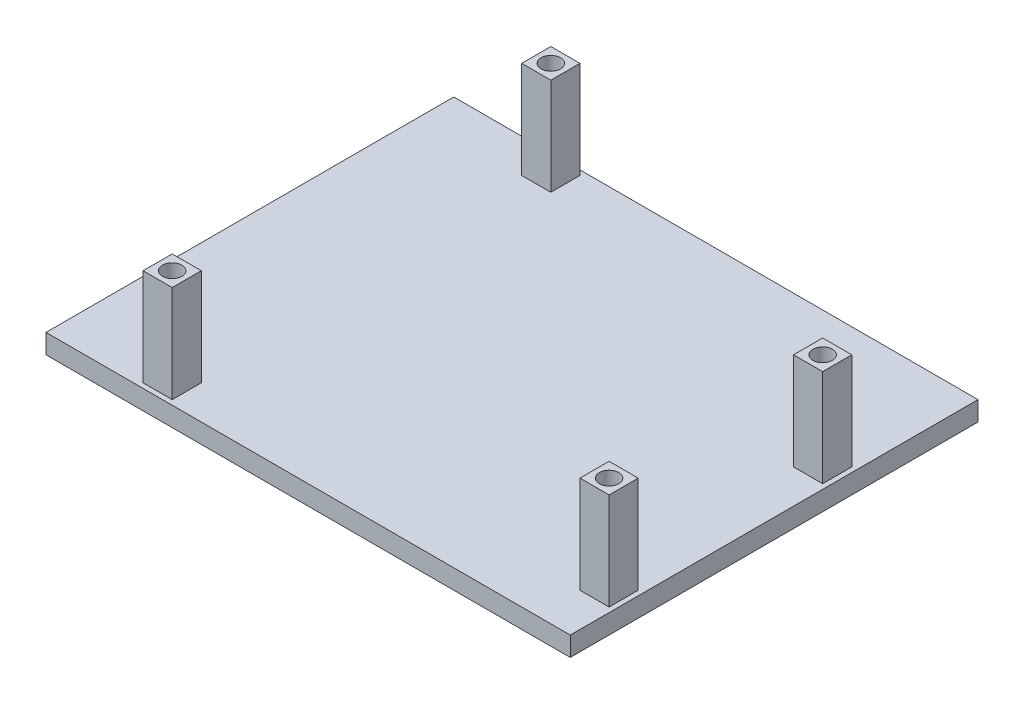
ISO-10303-21;
HEADER;
FILE_DESCRIPTION(('STEP AP214'),'2;1');
FILE_NAME('part.step','',(''),(''),'','','');
FILE_SCHEMA(('AUTOMOTIVE_DESIGN { 1 0 10303 214 1 1 1 1 }'));
ENDSEC;
DATA;
#1=APPLICATION_CONTEXT('core data for automotive mechanical design processes');
#2=APPLICATION_PROTOCOL_DEFINITION('international standard','automotive_design',2000,#1);
#3=PRODUCT_CONTEXT('',#1,'mechanical');
#4=PRODUCT('Part','Part','',(#3));
#5=PRODUCT_RELATED_PRODUCT_CATEGORY('part','',(#4));
#6=PRODUCT_DEFINITION_FORMATION('','',#4);
#7=PRODUCT_DEFINITION_CONTEXT('part definition',#1,'design');
#8=PRODUCT_DEFINITION('design','',#6,#7);
#9=PRODUCT_DEFINITION_SHAPE('','',#8);
#10=(LENGTH_UNIT() NAMED_UNIT(*) SI_UNIT(.MILLI.,.METRE.));
#11=(NAMED_UNIT(*) PLANE_ANGLE_UNIT() SI_UNIT($,.RADIAN.));
#12=(NAMED_UNIT(*) SI_UNIT($,.STERADIAN.) SOLID_ANGLE_UNIT());
#13=UNCERTAINTY_MEASURE_WITH_UNIT(LENGTH_MEASURE(1.E-05),#10,'distance_accuracy_value','');
#14=(GEOMETRIC_REPRESENTATION_CONTEXT(3) GLOBAL_UNCERTAINTY_ASSIGNED_CONTEXT((#13)) GLOBAL_UNIT_ASSIGNED_CONTEXT((#10,
#11,#12)) REPRESENTATION_CONTEXT('',''));
#15=CARTESIAN_POINT('',(0.,0.,0.));
#16=DIRECTION('',(0.,0.,1.));
#17=DIRECTION('',(1.,0.,0.));
#18=AXIS2_PLACEMENT_3D('',#15,#16,#17);
#19=CARTESIAN_POINT('',(0.,2.54,0.));
#20=DIRECTION('',(1.,0.,0.));
#21=DIRECTION('',(0.,0.,-1.));
#22=AXIS2_PLACEMENT_3D('',#19,#20,#21);
#23=PLANE('',#22);
#24=DIRECTION('',(0.,0.,1.));
#25=VECTOR('',#24,1.);
#26=CARTESIAN_POINT('',(0.,0.,0.));
#27=LINE('',#26,#25);
#28=CARTESIAN_POINT('',(0.,0.,-53.34));
#29=VERTEX_POINT('',#28);
#30=CARTESIAN_POINT('',(0.,0.,0.));
#31=VERTEX_POINT('',#30);
#32=EDGE_CURVE('E313',#29,#31,#27,.T.);
#33=ORIENTED_EDGE('',*,*,#32,.T.);
#34=DIRECTION('',(0.,-1.,0.));
#35=VECTOR('',#34,1.);
#36=CARTESIAN_POINT('',(0.,2.54,0.));
#37=LINE('',#36,#35);
#38=CARTESIAN_POINT('',(0.,2.54,0.));
#39=VERTEX_POINT('',#38);
#40=EDGE_CURVE('E11',#39,#31,#37,.T.);
#41=ORIENTED_EDGE('',*,*,#40,.F.);
#42=DIRECTION('',(0.,0.,1.));
#43=VECTOR('',#42,1.);
#44=CARTESIAN_POINT('',(0.,2.54,0.));
#45=LINE('',#44,#43);
#46=CARTESIAN_POINT('',(0.,2.54,-53.34));
#47=VERTEX_POINT('',#46);
#48=EDGE_CURVE('E314',#47,#39,#45,.T.);
#49=ORIENTED_EDGE('',*,*,#48,.F.);
#50=DIRECTION('',(0.,-1.,0.));
#51=VECTOR('',#50,1.);
#52=CARTESIAN_POINT('',(0.,2.54,-53.34));
#53=LINE('',#52,#51);
#54=EDGE_CURVE('E324',#47,#29,#53,.T.);
#55=ORIENTED_EDGE('',*,*,#54,.T.);
#56=EDGE_LOOP('',(#33,#41,#49,#55));
#57=FACE_BOUND('',#56,.T.);
#58=ADVANCED_FACE('F33',(#57),#23,.F.);
#59=CARTESIAN_POINT('',(0.,2.54,0.));
#60=DIRECTION('',(0.,0.,-1.));
#61=DIRECTION('',(-1.,0.,0.));
#62=AXIS2_PLACEMENT_3D('',#59,#60,#61);
#63=PLANE('',#62);
#64=DIRECTION('',(1.,0.,0.));
#65=VECTOR('',#64,1.);
#66=CARTESIAN_POINT('',(0.,0.,0.));
#67=LINE('',#66,#65);
#68=CARTESIAN_POINT('',(68.58,0.,0.));
#69=VERTEX_POINT('',#68);
#70=EDGE_CURVE('E327',#31,#69,#67,.T.);
#71=ORIENTED_EDGE('',*,*,#70,.T.);
#72=DIRECTION('',(0.,-1.,0.));
#73=VECTOR('',#72,1.);
#74=CARTESIAN_POINT('',(68.58,2.54,0.));
#75=LINE('',#74,#73);
#76=CARTESIAN_POINT('',(68.58,2.54,0.));
#77=VERTEX_POINT('',#76);
#78=EDGE_CURVE('E40',#77,#69,#75,.T.);
#79=ORIENTED_EDGE('',*,*,#78,.F.);
#80=DIRECTION('',(1.,0.,0.));
#81=VECTOR('',#80,1.);
#82=CARTESIAN_POINT('',(0.,2.54,0.));
#83=LINE('',#82,#81);
#84=EDGE_CURVE('E317',#39,#77,#83,.T.);
#85=ORIENTED_EDGE('',*,*,#84,.F.);
#86=ORIENTED_EDGE('',*,*,#40,.T.);
#87=EDGE_LOOP('',(#71,#79,#85,#86));
#88=FACE_BOUND('',#87,.T.);
#89=ADVANCED_FACE('F357',(#88),#63,.F.);
#90=CARTESIAN_POINT('',(68.58,2.54,0.));
#91=DIRECTION('',(-1.,0.,0.));
#92=DIRECTION('',(0.,0.,1.));
#93=AXIS2_PLACEMENT_3D('',#90,#91,#92);
#94=PLANE('',#93);
#95=DIRECTION('',(0.,0.,-1.));
#96=VECTOR('',#95,1.);
#97=CARTESIAN_POINT('',(68.58,0.,0.));
#98=LINE('',#97,#96);
#99=CARTESIAN_POINT('',(68.58,0.,-53.34));
#100=VERTEX_POINT('',#99);
#101=EDGE_CURVE('E329',#69,#100,#98,.T.);
#102=ORIENTED_EDGE('',*,*,#101,.T.);
#103=DIRECTION('',(0.,-1.,0.));
#104=VECTOR('',#103,1.);
#105=CARTESIAN_POINT('',(68.58,2.54,-53.34));
#106=LINE('',#105,#104);
#107=CARTESIAN_POINT('',(68.58,2.54,-53.34));
#108=VERTEX_POINT('',#107);
#109=EDGE_CURVE('E334',#108,#100,#106,.T.);
#110=ORIENTED_EDGE('',*,*,#109,.F.);
#111=DIRECTION('',(0.,0.,-1.));
#112=VECTOR('',#111,1.);
#113=CARTESIAN_POINT('',(68.58,2.54,0.));
#114=LINE('',#113,#112);
#115=EDGE_CURVE('E320',#77,#108,#114,.T.);
#116=ORIENTED_EDGE('',*,*,#115,.F.);
#117=ORIENTED_EDGE('',*,*,#78,.T.);
#118=EDGE_LOOP('',(#102,#110,#116,#117));
#119=FACE_BOUND('',#118,.T.);
#120=ADVANCED_FACE('F341',(#119),#94,.F.);
#121=CARTESIAN_POINT('',(0.,2.54,-53.34));
#122=DIRECTION('',(0.,0.,1.));
#123=DIRECTION('',(1.,0.,0.));
#124=AXIS2_PLACEMENT_3D('',#121,#122,#123);
#125=PLANE('',#124);
#126=DIRECTION('',(-1.,0.,0.));
#127=VECTOR('',#126,1.);
#128=CARTESIAN_POINT('',(0.,0.,-53.34));
#129=LINE('',#128,#127);
#130=EDGE_CURVE('E318',#100,#29,#129,.T.);
#131=ORIENTED_EDGE('',*,*,#130,.T.);
#132=ORIENTED_EDGE('',*,*,#54,.F.);
#133=DIRECTION('',(-1.,0.,0.));
#134=VECTOR('',#133,1.);
#135=CARTESIAN_POINT('',(0.,2.54,-53.34));
#136=LINE('',#135,#134);
#137=EDGE_CURVE('E322',#108,#47,#136,.T.);
#138=ORIENTED_EDGE('',*,*,#137,.F.);
#139=ORIENTED_EDGE('',*,*,#109,.T.);
#140=EDGE_LOOP('',(#131,#132,#138,#139));
#141=FACE_BOUND('',#140,.T.);
#142=ADVANCED_FACE('F350',(#141),#125,.F.);
#143=CARTESIAN_POINT('',(0.,2.54,0.));
#144=DIRECTION('',(0.,-1.,0.));
#145=DIRECTION('',(0.,0.,-1.));
#146=AXIS2_PLACEMENT_3D('',#143,#144,#145);
#147=PLANE('',#146);
#148=DIRECTION('',(0.,0.,-1.));
#149=VECTOR('',#148,1.);
#150=CARTESIAN_POINT('',(67.945,2.54,-5.71500000000001));
#151=LINE('',#150,#149);
#152=CARTESIAN_POINT('',(67.945,2.54,-5.71500000000001));
#153=VERTEX_POINT('',#152);
#154=CARTESIAN_POINT('',(67.945,2.54,-9.52500000000001));
#155=VERTEX_POINT('',#154);
#156=EDGE_CURVE('E190',#153,#155,#151,.T.);
#157=ORIENTED_EDGE('',*,*,#156,.F.);
#158=DIRECTION('',(1.,0.,0.));
#159=VECTOR('',#158,1.);
#160=CARTESIAN_POINT('',(64.135,2.54,-5.71500000000001));
#161=LINE('',#160,#159);
#162=CARTESIAN_POINT('',(64.135,2.54,-5.71500000000001));
#163=VERTEX_POINT('',#162);
#164=EDGE_CURVE('E187',#163,#153,#161,.T.);
#165=ORIENTED_EDGE('',*,*,#164,.F.);
#166=DIRECTION('',(0.,0.,1.));
#167=VECTOR('',#166,1.);
#168=CARTESIAN_POINT('',(64.135,2.54,-5.71500000000001));
#169=LINE('',#168,#167);
#170=CARTESIAN_POINT('',(64.135,2.54,-9.52500000000001));
#171=VERTEX_POINT('',#170);
#172=EDGE_CURVE('E52',#171,#163,#169,.T.);
#173=ORIENTED_EDGE('',*,*,#172,.F.);
#174=DIRECTION('',(-1.,0.,0.));
#175=VECTOR('',#174,1.);
#176=CARTESIAN_POINT('',(64.135,2.54,-9.52500000000001));
#177=LINE('',#176,#175);
#178=EDGE_CURVE('E47',#155,#171,#177,.T.);
#179=ORIENTED_EDGE('',*,*,#178,.F.);
#180=EDGE_LOOP('',(#157,#165,#173,#179));
#181=FACE_BOUND('',#180,.T.);
#182=DIRECTION('',(0.,0.,-1.));
#183=VECTOR('',#182,1.);
#184=CARTESIAN_POINT('',(67.945,2.54,-33.655));
#185=LINE('',#184,#183);
#186=CARTESIAN_POINT('',(67.945,2.54,-33.655));
#187=VERTEX_POINT('',#186);
#188=CARTESIAN_POINT('',(67.945,2.54,-37.465));
#189=VERTEX_POINT('',#188);
#190=EDGE_CURVE('E201',#187,#189,#185,.T.);
#191=ORIENTED_EDGE('',*,*,#190,.F.);
#192=DIRECTION('',(1.,0.,0.));
#193=VECTOR('',#192,1.);
#194=CARTESIAN_POINT('',(64.135,2.54,-33.655));
#195=LINE('',#194,#193);
#196=CARTESIAN_POINT('',(64.135,2.54,-33.655));
#197=VERTEX_POINT('',#196);
#198=EDGE_CURVE('E207',#197,#187,#195,.T.);
#199=ORIENTED_EDGE('',*,*,#198,.F.);
#200=DIRECTION('',(0.,0.,1.));
#201=VECTOR('',#200,1.);
#202=CARTESIAN_POINT('',(64.135,2.54,-33.655));
#203=LINE('',#202,#201);
#204=CARTESIAN_POINT('',(64.135,2.54,-37.465));
#205=VERTEX_POINT('',#204);
#206=EDGE_CURVE('E219',#205,#197,#203,.T.);
#207=ORIENTED_EDGE('',*,*,#206,.F.);
#208=DIRECTION('',(-1.,0.,0.));
#209=VECTOR('',#208,1.);
#210=CARTESIAN_POINT('',(64.135,2.54,-37.465));
#211=LINE('',#210,#209);
#212=EDGE_CURVE('E216',#189,#205,#211,.T.);
#213=ORIENTED_EDGE('',*,*,#212,.F.);
#214=EDGE_LOOP('',(#191,#199,#207,#213));
#215=FACE_BOUND('',#214,.T.);
#216=DIRECTION('',(0.,0.,-1.));
#217=VECTOR('',#216,1.);
#218=CARTESIAN_POINT('',(17.145,2.54,-52.705));
#219=LINE('',#218,#217);
#220=CARTESIAN_POINT('',(17.145,2.54,-48.895));
#221=VERTEX_POINT('',#220);
#222=CARTESIAN_POINT('',(17.145,2.54,-52.705));
#223=VERTEX_POINT('',#222);
#224=EDGE_CURVE('E239',#221,#223,#219,.T.);
#225=ORIENTED_EDGE('',*,*,#224,.F.);
#226=DIRECTION('',(1.,0.,0.));
#227=VECTOR('',#226,1.);
#228=CARTESIAN_POINT('',(13.335,2.54,-48.895));
#229=LINE('',#228,#227);
#230=CARTESIAN_POINT('',(13.335,2.54,-48.895));
#231=VERTEX_POINT('',#230);
#232=EDGE_CURVE('E246',#231,#221,#229,.T.);
#233=ORIENTED_EDGE('',*,*,#232,.F.);
#234=DIRECTION('',(0.,0.,1.));
#235=VECTOR('',#234,1.);
#236=CARTESIAN_POINT('',(13.335,2.54,-52.705));
#237=LINE('',#236,#235);
#238=CARTESIAN_POINT('',(13.335,2.54,-52.705));
#239=VERTEX_POINT('',#238);
#240=EDGE_CURVE('E258',#239,#231,#237,.T.);
#241=ORIENTED_EDGE('',*,*,#240,.F.);
#242=DIRECTION('',(-1.,0.,0.));
#243=VECTOR('',#242,1.);
#244=CARTESIAN_POINT('',(13.335,2.54,-52.705));
#245=LINE('',#244,#243);
#246=EDGE_CURVE('E255',#223,#239,#245,.T.);
#247=ORIENTED_EDGE('',*,*,#246,.F.);
#248=EDGE_LOOP('',(#225,#233,#241,#247));
#249=FACE_BOUND('',#248,.T.);
#250=DIRECTION('',(0.,0.,-1.));
#251=VECTOR('',#250,1.);
#252=CARTESIAN_POINT('',(15.875,2.54,-0.635000000000001));
#253=LINE('',#252,#251);
#254=CARTESIAN_POINT('',(15.875,2.54,-0.635000000000001));
#255=VERTEX_POINT('',#254);
#256=CARTESIAN_POINT('',(15.875,2.54,-4.445));
#257=VERTEX_POINT('',#256);
#258=EDGE_CURVE('E278',#255,#257,#253,.T.);
#259=ORIENTED_EDGE('',*,*,#258,.F.);
#260=DIRECTION('',(1.,0.,0.));
#261=VECTOR('',#260,1.);
#262=CARTESIAN_POINT('',(12.065,2.54,-0.635000000000001));
#263=LINE('',#262,#261);
#264=CARTESIAN_POINT('',(12.065,2.54,-0.635000000000001));
#265=VERTEX_POINT('',#264);
#266=EDGE_CURVE('E285',#265,#255,#263,.T.);
#267=ORIENTED_EDGE('',*,*,#266,.F.);
#268=DIRECTION('',(0.,0.,1.));
#269=VECTOR('',#268,1.);
#270=CARTESIAN_POINT('',(12.065,2.54,-0.635000000000001));
#271=LINE('',#270,#269);
#272=CARTESIAN_POINT('',(12.065,2.54,-4.445));
#273=VERTEX_POINT('',#272);
#274=EDGE_CURVE('E297',#273,#265,#271,.T.);
#275=ORIENTED_EDGE('',*,*,#274,.F.);
#276=DIRECTION('',(-1.,0.,0.));
#277=VECTOR('',#276,1.);
#278=CARTESIAN_POINT('',(12.065,2.54,-4.445));
#279=LINE('',#278,#277);
#280=EDGE_CURVE('E294',#257,#273,#279,.T.);
#281=ORIENTED_EDGE('',*,*,#280,.F.);
#282=EDGE_LOOP('',(#259,#267,#275,#281));
#283=FACE_BOUND('',#282,.T.);
#284=ORIENTED_EDGE('',*,*,#48,.T.);
#285=ORIENTED_EDGE('',*,*,#84,.T.);
#286=ORIENTED_EDGE('',*,*,#115,.T.);
#287=ORIENTED_EDGE('',*,*,#137,.T.);
#288=EDGE_LOOP('',(#284,#285,#286,#287));
#289=FACE_BOUND('',#288,.T.);
#290=ADVANCED_FACE('F356',(#181,#215,#249,#283,#289),#147,.F.);
#291=CARTESIAN_POINT('',(0.,0.,0.));
#292=DIRECTION('',(0.,-1.,0.));
#293=DIRECTION('',(0.,0.,-1.));
#294=AXIS2_PLACEMENT_3D('',#291,#292,#293);
#295=PLANE('',#294);
#296=ORIENTED_EDGE('',*,*,#32,.F.);
#297=ORIENTED_EDGE('',*,*,#130,.F.);
#298=ORIENTED_EDGE('',*,*,#101,.F.);
#299=ORIENTED_EDGE('',*,*,#70,.F.);
#300=EDGE_LOOP('',(#296,#297,#298,#299));
#301=FACE_BOUND('',#300,.T.);
#302=ADVANCED_FACE('F347',(#301),#295,.T.);
#303=CARTESIAN_POINT('',(0.,15.24,0.));
#304=DIRECTION('',(0.,-1.,0.));
#305=DIRECTION('',(0.,0.,-1.));
#306=AXIS2_PLACEMENT_3D('',#303,#304,#305);
#307=PLANE('',#306);
#308=DIRECTION('',(0.,0.,-1.));
#309=VECTOR('',#308,1.);
#310=CARTESIAN_POINT('',(15.875,15.24,-0.635000000000001));
#311=LINE('',#310,#309);
#312=CARTESIAN_POINT('',(15.875,15.24,-0.635000000000001));
#313=VERTEX_POINT('',#312);
#314=CARTESIAN_POINT('',(15.875,15.24,-4.445));
#315=VERTEX_POINT('',#314);
#316=EDGE_CURVE('E281',#313,#315,#311,.T.);
#317=ORIENTED_EDGE('',*,*,#316,.T.);
#318=DIRECTION('',(-1.,0.,0.));
#319=VECTOR('',#318,1.);
#320=CARTESIAN_POINT('',(12.065,15.24,-4.445));
#321=LINE('',#320,#319);
#322=CARTESIAN_POINT('',(12.065,15.24,-4.445));
#323=VERTEX_POINT('',#322);
#324=EDGE_CURVE('E284',#315,#323,#321,.T.);
#325=ORIENTED_EDGE('',*,*,#324,.T.);
#326=DIRECTION('',(0.,0.,1.));
#327=VECTOR('',#326,1.);
#328=CARTESIAN_POINT('',(12.065,15.24,-0.635000000000001));
#329=LINE('',#328,#327);
#330=CARTESIAN_POINT('',(12.065,15.24,-0.635000000000001));
#331=VERTEX_POINT('',#330);
#332=EDGE_CURVE('E287',#323,#331,#329,.T.);
#333=ORIENTED_EDGE('',*,*,#332,.T.);
#334=DIRECTION('',(1.,0.,0.));
#335=VECTOR('',#334,1.);
#336=CARTESIAN_POINT('',(12.065,15.24,-0.635000000000001));
#337=LINE('',#336,#335);
#338=EDGE_CURVE('E289',#331,#313,#337,.T.);
#339=ORIENTED_EDGE('',*,*,#338,.T.);
#340=EDGE_LOOP('',(#317,#325,#333,#339));
#341=FACE_BOUND('',#340,.T.);
#342=CARTESIAN_POINT('',(13.97,15.24,-2.54));
#343=DIRECTION('',(0.,1.,0.));
#344=DIRECTION('',(0.,0.,1.));
#345=AXIS2_PLACEMENT_3D('',#342,#343,#344);
#346=CIRCLE('',#345,1.27);
#347=CARTESIAN_POINT('',(13.97,15.24,-1.27));
#348=VERTEX_POINT('',#347);
#349=EDGE_CURVE('E275',#348,#348,#346,.T.);
#350=ORIENTED_EDGE('',*,*,#349,.F.);
#351=EDGE_LOOP('',(#350));
#352=FACE_BOUND('',#351,.T.);
#353=ADVANCED_FACE('F369',(#341,#352),#307,.F.);
#354=CARTESIAN_POINT('',(15.875,15.24,-0.635000000000001));
#355=DIRECTION('',(-1.,0.,0.));
#356=DIRECTION('',(0.,0.,1.));
#357=AXIS2_PLACEMENT_3D('',#354,#355,#356);
#358=PLANE('',#357);
#359=ORIENTED_EDGE('',*,*,#258,.T.);
#360=DIRECTION('',(0.,-1.,0.));
#361=VECTOR('',#360,1.);
#362=CARTESIAN_POINT('',(15.875,15.24,-4.445));
#363=LINE('',#362,#361);
#364=EDGE_CURVE('E310',#315,#257,#363,.T.);
#365=ORIENTED_EDGE('',*,*,#364,.F.);
#366=ORIENTED_EDGE('',*,*,#316,.F.);
#367=DIRECTION('',(0.,-1.,0.));
#368=VECTOR('',#367,1.);
#369=CARTESIAN_POINT('',(15.875,15.24,-0.635000000000001));
#370=LINE('',#369,#368);
#371=EDGE_CURVE('E291',#313,#255,#370,.T.);
#372=ORIENTED_EDGE('',*,*,#371,.T.);
#373=EDGE_LOOP('',(#359,#365,#366,#372));
#374=FACE_BOUND('',#373,.T.);
#375=ADVANCED_FACE('F374',(#374),#358,.F.);
#376=CARTESIAN_POINT('',(12.065,15.24,-4.445));
#377=DIRECTION('',(0.,0.,1.));
#378=DIRECTION('',(1.,0.,0.));
#379=AXIS2_PLACEMENT_3D('',#376,#377,#378);
#380=PLANE('',#379);
#381=ORIENTED_EDGE('',*,*,#280,.T.);
#382=DIRECTION('',(0.,-1.,0.));
#383=VECTOR('',#382,1.);
#384=CARTESIAN_POINT('',(12.065,15.24,-4.445));
#385=LINE('',#384,#383);
#386=EDGE_CURVE('E307',#323,#273,#385,.T.);
#387=ORIENTED_EDGE('',*,*,#386,.F.);
#388=ORIENTED_EDGE('',*,*,#324,.F.);
#389=ORIENTED_EDGE('',*,*,#364,.T.);
#390=EDGE_LOOP('',(#381,#387,#388,#389));
#391=FACE_BOUND('',#390,.T.);
#392=ADVANCED_FACE('F377',(#391),#380,.F.);
#393=CARTESIAN_POINT('',(12.065,15.24,-0.635000000000001));
#394=DIRECTION('',(1.,0.,0.));
#395=DIRECTION('',(0.,0.,-1.));
#396=AXIS2_PLACEMENT_3D('',#393,#394,#395);
#397=PLANE('',#396);
#398=ORIENTED_EDGE('',*,*,#274,.T.);
#399=DIRECTION('',(0.,-1.,0.));
#400=VECTOR('',#399,1.);
#401=CARTESIAN_POINT('',(12.065,15.24,-0.635000000000001));
#402=LINE('',#401,#400);
#403=EDGE_CURVE('E304',#331,#265,#402,.T.);
#404=ORIENTED_EDGE('',*,*,#403,.F.);
#405=ORIENTED_EDGE('',*,*,#332,.F.);
#406=ORIENTED_EDGE('',*,*,#386,.T.);
#407=EDGE_LOOP('',(#398,#404,#405,#406));
#408=FACE_BOUND('',#407,.T.);
#409=ADVANCED_FACE('F381',(#408),#397,.F.);
#410=CARTESIAN_POINT('',(12.065,15.24,-0.635000000000001));
#411=DIRECTION('',(0.,0.,-1.));
#412=DIRECTION('',(-1.,0.,0.));
#413=AXIS2_PLACEMENT_3D('',#410,#411,#412);
#414=PLANE('',#413);
#415=ORIENTED_EDGE('',*,*,#266,.T.);
#416=ORIENTED_EDGE('',*,*,#371,.F.);
#417=ORIENTED_EDGE('',*,*,#338,.F.);
#418=ORIENTED_EDGE('',*,*,#403,.T.);
#419=EDGE_LOOP('',(#415,#416,#417,#418));
#420=FACE_BOUND('',#419,.T.);
#421=ADVANCED_FACE('F385',(#420),#414,.F.);
#422=CARTESIAN_POINT('',(13.97,15.24,-2.54));
#423=DIRECTION('',(0.,-1.,0.));
#424=DIRECTION('',(0.,0.,-1.));
#425=AXIS2_PLACEMENT_3D('',#422,#423,#424);
#426=CYLINDRICAL_SURFACE('',#425,1.27);
#427=ORIENTED_EDGE('',*,*,#349,.T.);
#428=EDGE_LOOP('',(#427));
#429=FACE_BOUND('',#428,.T.);
#430=CARTESIAN_POINT('',(13.97,2.54,-2.54));
#431=DIRECTION('',(0.,1.,0.));
#432=DIRECTION('',(0.,0.,1.));
#433=AXIS2_PLACEMENT_3D('',#430,#431,#432);
#434=CIRCLE('',#433,1.27);
#435=CARTESIAN_POINT('',(13.97,2.54,-1.27));
#436=VERTEX_POINT('',#435);
#437=EDGE_CURVE('E274',#436,#436,#434,.T.);
#438=ORIENTED_EDGE('',*,*,#437,.F.);
#439=EDGE_LOOP('',(#438));
#440=FACE_BOUND('',#439,.T.);
#441=ADVANCED_FACE('F389',(#429,#440),#426,.F.);
#442=ORIENTED_EDGE('',*,*,#437,.T.);
#443=EDGE_LOOP('',(#442));
#444=FACE_BOUND('',#443,.T.);
#445=ADVANCED_FACE('F373',(#444),#147,.F.);
#446=CARTESIAN_POINT('',(0.,15.24,0.));
#447=DIRECTION('',(0.,1.,0.));
#448=DIRECTION('',(0.,0.,1.));
#449=AXIS2_PLACEMENT_3D('',#446,#447,#448);
#450=PLANE('',#449);
#451=DIRECTION('',(0.,0.,-1.));
#452=VECTOR('',#451,1.);
#453=CARTESIAN_POINT('',(17.145,15.24,-52.705));
#454=LINE('',#453,#452);
#455=CARTESIAN_POINT('',(17.145,15.24,-48.895));
#456=VERTEX_POINT('',#455);
#457=CARTESIAN_POINT('',(17.145,15.24,-52.705));
#458=VERTEX_POINT('',#457);
#459=EDGE_CURVE('E242',#456,#458,#454,.T.);
#460=ORIENTED_EDGE('',*,*,#459,.T.);
#461=DIRECTION('',(-1.,0.,0.));
#462=VECTOR('',#461,1.);
#463=CARTESIAN_POINT('',(13.335,15.24,-52.705));
#464=LINE('',#463,#462);
#465=CARTESIAN_POINT('',(13.335,15.24,-52.705));
#466=VERTEX_POINT('',#465);
#467=EDGE_CURVE('E245',#458,#466,#464,.T.);
#468=ORIENTED_EDGE('',*,*,#467,.T.);
#469=DIRECTION('',(0.,0.,1.));
#470=VECTOR('',#469,1.);
#471=CARTESIAN_POINT('',(13.335,15.24,-52.705));
#472=LINE('',#471,#470);
#473=CARTESIAN_POINT('',(13.335,15.24,-48.895));
#474=VERTEX_POINT('',#473);
#475=EDGE_CURVE('E248',#466,#474,#472,.T.);
#476=ORIENTED_EDGE('',*,*,#475,.T.);
#477=DIRECTION('',(1.,0.,0.));
#478=VECTOR('',#477,1.);
#479=CARTESIAN_POINT('',(13.335,15.24,-48.895));
#480=LINE('',#479,#478);
#481=EDGE_CURVE('E250',#474,#456,#480,.T.);
#482=ORIENTED_EDGE('',*,*,#481,.T.);
#483=EDGE_LOOP('',(#460,#468,#476,#482));
#484=FACE_BOUND('',#483,.T.);
#485=CARTESIAN_POINT('',(15.24,15.24,-50.8));
#486=DIRECTION('',(0.,1.,0.));
#487=DIRECTION('',(0.,0.,1.));
#488=AXIS2_PLACEMENT_3D('',#485,#486,#487);
#489=CIRCLE('',#488,1.27);
#490=CARTESIAN_POINT('',(15.24,15.24,-49.53));
#491=VERTEX_POINT('',#490);
#492=EDGE_CURVE('E236',#491,#491,#489,.T.);
#493=ORIENTED_EDGE('',*,*,#492,.F.);
#494=EDGE_LOOP('',(#493));
#495=FACE_BOUND('',#494,.T.);
#496=ADVANCED_FACE('F401',(#484,#495),#450,.T.);
#497=CARTESIAN_POINT('',(17.145,15.24,-52.705));
#498=DIRECTION('',(-1.,0.,0.));
#499=DIRECTION('',(0.,0.,1.));
#500=AXIS2_PLACEMENT_3D('',#497,#498,#499);
#501=PLANE('',#500);
#502=ORIENTED_EDGE('',*,*,#224,.T.);
#503=DIRECTION('',(0.,-1.,0.));
#504=VECTOR('',#503,1.);
#505=CARTESIAN_POINT('',(17.145,15.24,-52.705));
#506=LINE('',#505,#504);
#507=EDGE_CURVE('E271',#458,#223,#506,.T.);
#508=ORIENTED_EDGE('',*,*,#507,.F.);
#509=ORIENTED_EDGE('',*,*,#459,.F.);
#510=DIRECTION('',(0.,-1.,0.));
#511=VECTOR('',#510,1.);
#512=CARTESIAN_POINT('',(17.145,15.24,-48.895));
#513=LINE('',#512,#511);
#514=EDGE_CURVE('E252',#456,#221,#513,.T.);
#515=ORIENTED_EDGE('',*,*,#514,.T.);
#516=EDGE_LOOP('',(#502,#508,#509,#515));
#517=FACE_BOUND('',#516,.T.);
#518=ADVANCED_FACE('F397',(#517),#501,.F.);
#519=CARTESIAN_POINT('',(13.335,15.24,-52.705));
#520=DIRECTION('',(0.,0.,1.));
#521=DIRECTION('',(1.,0.,0.));
#522=AXIS2_PLACEMENT_3D('',#519,#520,#521);
#523=PLANE('',#522);
#524=ORIENTED_EDGE('',*,*,#246,.T.);
#525=DIRECTION('',(0.,-1.,0.));
#526=VECTOR('',#525,1.);
#527=CARTESIAN_POINT('',(13.335,15.24,-52.705));
#528=LINE('',#527,#526);
#529=EDGE_CURVE('E268',#466,#239,#528,.T.);
#530=ORIENTED_EDGE('',*,*,#529,.F.);
#531=ORIENTED_EDGE('',*,*,#467,.F.);
#532=ORIENTED_EDGE('',*,*,#507,.T.);
#533=EDGE_LOOP('',(#524,#530,#531,#532));
#534=FACE_BOUND('',#533,.T.);
#535=ADVANCED_FACE('F400',(#534),#523,.F.);
#536=CARTESIAN_POINT('',(13.335,15.24,-52.705));
#537=DIRECTION('',(1.,0.,0.));
#538=DIRECTION('',(0.,0.,-1.));
#539=AXIS2_PLACEMENT_3D('',#536,#537,#538);
#540=PLANE('',#539);
#541=ORIENTED_EDGE('',*,*,#240,.T.);
#542=DIRECTION('',(0.,-1.,0.));
#543=VECTOR('',#542,1.);
#544=CARTESIAN_POINT('',(13.335,15.24,-48.895));
#545=LINE('',#544,#543);
#546=EDGE_CURVE('E265',#474,#231,#545,.T.);
#547=ORIENTED_EDGE('',*,*,#546,.F.);
#548=ORIENTED_EDGE('',*,*,#475,.F.);
#549=ORIENTED_EDGE('',*,*,#529,.T.);
#550=EDGE_LOOP('',(#541,#547,#548,#549));
#551=FACE_BOUND('',#550,.T.);
#552=ADVANCED_FACE('F405',(#551),#540,.F.);
#553=CARTESIAN_POINT('',(13.335,15.24,-48.895));
#554=DIRECTION('',(0.,0.,-1.));
#555=DIRECTION('',(-1.,0.,0.));
#556=AXIS2_PLACEMENT_3D('',#553,#554,#555);
#557=PLANE('',#556);
#558=ORIENTED_EDGE('',*,*,#232,.T.);
#559=ORIENTED_EDGE('',*,*,#514,.F.);
#560=ORIENTED_EDGE('',*,*,#481,.F.);
#561=ORIENTED_EDGE('',*,*,#546,.T.);
#562=EDGE_LOOP('',(#558,#559,#560,#561));
#563=FACE_BOUND('',#562,.T.);
#564=ADVANCED_FACE('F409',(#563),#557,.F.);
#565=CARTESIAN_POINT('',(15.24,15.24,-50.8));
#566=DIRECTION('',(0.,-1.,0.));
#567=DIRECTION('',(0.,0.,-1.));
#568=AXIS2_PLACEMENT_3D('',#565,#566,#567);
#569=CYLINDRICAL_SURFACE('',#568,1.27);
#570=ORIENTED_EDGE('',*,*,#492,.T.);
#571=EDGE_LOOP('',(#570));
#572=FACE_BOUND('',#571,.T.);
#573=CARTESIAN_POINT('',(15.24,2.54,-50.8));
#574=DIRECTION('',(0.,1.,0.));
#575=DIRECTION('',(0.,0.,1.));
#576=AXIS2_PLACEMENT_3D('',#573,#574,#575);
#577=CIRCLE('',#576,1.27);
#578=CARTESIAN_POINT('',(15.24,2.54,-49.53));
#579=VERTEX_POINT('',#578);
#580=EDGE_CURVE('E235',#579,#579,#577,.T.);
#581=ORIENTED_EDGE('',*,*,#580,.F.);
#582=EDGE_LOOP('',(#581));
#583=FACE_BOUND('',#582,.T.);
#584=ADVANCED_FACE('F413',(#572,#583),#569,.F.);
#585=ORIENTED_EDGE('',*,*,#580,.T.);
#586=EDGE_LOOP('',(#585));
#587=FACE_BOUND('',#586,.T.);
#588=ADVANCED_FACE('F420',(#587),#147,.F.);
#589=CARTESIAN_POINT('',(0.,15.24,0.));
#590=DIRECTION('',(0.,-1.,0.));
#591=DIRECTION('',(0.,0.,-1.));
#592=AXIS2_PLACEMENT_3D('',#589,#590,#591);
#593=PLANE('',#592);
#594=DIRECTION('',(0.,0.,-1.));
#595=VECTOR('',#594,1.);
#596=CARTESIAN_POINT('',(67.945,15.24,-33.655));
#597=LINE('',#596,#595);
#598=CARTESIAN_POINT('',(67.945,15.24,-33.655));
#599=VERTEX_POINT('',#598);
#600=CARTESIAN_POINT('',(67.945,15.24,-37.465));
#601=VERTEX_POINT('',#600);
#602=EDGE_CURVE('E203',#599,#601,#597,.T.);
#603=ORIENTED_EDGE('',*,*,#602,.T.);
#604=DIRECTION('',(-1.,0.,0.));
#605=VECTOR('',#604,1.);
#606=CARTESIAN_POINT('',(64.135,15.24,-37.465));
#607=LINE('',#606,#605);
#608=CARTESIAN_POINT('',(64.135,15.24,-37.465));
#609=VERTEX_POINT('',#608);
#610=EDGE_CURVE('E206',#601,#609,#607,.T.);
#611=ORIENTED_EDGE('',*,*,#610,.T.);
#612=DIRECTION('',(0.,0.,1.));
#613=VECTOR('',#612,1.);
#614=CARTESIAN_POINT('',(64.135,15.24,-33.655));
#615=LINE('',#614,#613);
#616=CARTESIAN_POINT('',(64.135,15.24,-33.655));
#617=VERTEX_POINT('',#616);
#618=EDGE_CURVE('E209',#609,#617,#615,.T.);
#619=ORIENTED_EDGE('',*,*,#618,.T.);
#620=DIRECTION('',(1.,0.,0.));
#621=VECTOR('',#620,1.);
#622=CARTESIAN_POINT('',(64.135,15.24,-33.655));
#623=LINE('',#622,#621);
#624=EDGE_CURVE('E211',#617,#599,#623,.T.);
#625=ORIENTED_EDGE('',*,*,#624,.T.);
#626=EDGE_LOOP('',(#603,#611,#619,#625));
#627=FACE_BOUND('',#626,.T.);
#628=CARTESIAN_POINT('',(66.04,15.24,-35.56));
#629=DIRECTION('',(0.,1.,0.));
#630=DIRECTION('',(0.,0.,1.));
#631=AXIS2_PLACEMENT_3D('',#628,#629,#630);
#632=CIRCLE('',#631,1.26999999999999);
#633=CARTESIAN_POINT('',(66.04,15.24,-34.29));
#634=VERTEX_POINT('',#633);
#635=EDGE_CURVE('E194',#634,#634,#632,.T.);
#636=ORIENTED_EDGE('',*,*,#635,.F.);
#637=EDGE_LOOP('',(#636));
#638=FACE_BOUND('',#637,.T.);
#639=ADVANCED_FACE('F426',(#627,#638),#593,.F.);
#640=CARTESIAN_POINT('',(67.945,15.24,-33.655));
#641=DIRECTION('',(-1.,0.,0.));
#642=DIRECTION('',(0.,0.,1.));
#643=AXIS2_PLACEMENT_3D('',#640,#641,#642);
#644=PLANE('',#643);
#645=ORIENTED_EDGE('',*,*,#190,.T.);
#646=DIRECTION('',(0.,-1.,0.));
#647=VECTOR('',#646,1.);
#648=CARTESIAN_POINT('',(67.945,15.24,-37.465));
#649=LINE('',#648,#647);
#650=EDGE_CURVE('E232',#601,#189,#649,.T.);
#651=ORIENTED_EDGE('',*,*,#650,.F.);
#652=ORIENTED_EDGE('',*,*,#602,.F.);
#653=DIRECTION('',(0.,-1.,0.));
#654=VECTOR('',#653,1.);
#655=CARTESIAN_POINT('',(67.945,15.24,-33.655));
#656=LINE('',#655,#654);
#657=EDGE_CURVE('E213',#599,#187,#656,.T.);
#658=ORIENTED_EDGE('',*,*,#657,.T.);
#659=EDGE_LOOP('',(#645,#651,#652,#658));
#660=FACE_BOUND('',#659,.T.);
#661=ADVANCED_FACE('F422',(#660),#644,.F.);
#662=CARTESIAN_POINT('',(64.135,15.24,-37.465));
#663=DIRECTION('',(0.,0.,1.));
#664=DIRECTION('',(1.,0.,0.));
#665=AXIS2_PLACEMENT_3D('',#662,#663,#664);
#666=PLANE('',#665);
#667=ORIENTED_EDGE('',*,*,#212,.T.);
#668=DIRECTION('',(0.,-1.,0.));
#669=VECTOR('',#668,1.);
#670=CARTESIAN_POINT('',(64.135,15.24,-37.465));
#671=LINE('',#670,#669);
#672=EDGE_CURVE('E229',#609,#205,#671,.T.);
#673=ORIENTED_EDGE('',*,*,#672,.F.);
#674=ORIENTED_EDGE('',*,*,#610,.F.);
#675=ORIENTED_EDGE('',*,*,#650,.T.);
#676=EDGE_LOOP('',(#667,#673,#674,#675));
#677=FACE_BOUND('',#676,.T.);
#678=ADVANCED_FACE('F425',(#677),#666,.F.);
#679=CARTESIAN_POINT('',(64.135,15.24,-33.655));
#680=DIRECTION('',(1.,0.,0.));
#681=DIRECTION('',(0.,0.,-1.));
#682=AXIS2_PLACEMENT_3D('',#679,#680,#681);
#683=PLANE('',#682);
#684=ORIENTED_EDGE('',*,*,#206,.T.);
#685=DIRECTION('',(0.,-1.,0.));
#686=VECTOR('',#685,1.);
#687=CARTESIAN_POINT('',(64.135,15.24,-33.655));
#688=LINE('',#687,#686);
#689=EDGE_CURVE('E226',#617,#197,#688,.T.);
#690=ORIENTED_EDGE('',*,*,#689,.F.);
#691=ORIENTED_EDGE('',*,*,#618,.F.);
#692=ORIENTED_EDGE('',*,*,#672,.T.);
#693=EDGE_LOOP('',(#684,#690,#691,#692));
#694=FACE_BOUND('',#693,.T.);
#695=ADVANCED_FACE('F430',(#694),#683,.F.);
#696=CARTESIAN_POINT('',(64.135,15.24,-33.655));
#697=DIRECTION('',(0.,0.,-1.));
#698=DIRECTION('',(-1.,0.,0.));
#699=AXIS2_PLACEMENT_3D('',#696,#697,#698);
#700=PLANE('',#699);
#701=ORIENTED_EDGE('',*,*,#198,.T.);
#702=ORIENTED_EDGE('',*,*,#657,.F.);
#703=ORIENTED_EDGE('',*,*,#624,.F.);
#704=ORIENTED_EDGE('',*,*,#689,.T.);
#705=EDGE_LOOP('',(#701,#702,#703,#704));
#706=FACE_BOUND('',#705,.T.);
#707=ADVANCED_FACE('F434',(#706),#700,.F.);
#708=CARTESIAN_POINT('',(66.04,15.24,-35.56));
#709=DIRECTION('',(0.,-1.,0.));
#710=DIRECTION('',(0.,0.,-1.));
#711=AXIS2_PLACEMENT_3D('',#708,#709,#710);
#712=CYLINDRICAL_SURFACE('',#711,1.26999999999999);
#713=ORIENTED_EDGE('',*,*,#635,.T.);
#714=EDGE_LOOP('',(#713));
#715=FACE_BOUND('',#714,.T.);
#716=CARTESIAN_POINT('',(66.04,2.54,-35.56));
#717=DIRECTION('',(0.,1.,0.));
#718=DIRECTION('',(0.,0.,1.));
#719=AXIS2_PLACEMENT_3D('',#716,#717,#718);
#720=CIRCLE('',#719,1.26999999999999);
#721=CARTESIAN_POINT('',(66.04,2.54,-34.29));
#722=VERTEX_POINT('',#721);
#723=EDGE_CURVE('E191',#722,#722,#720,.T.);
#724=ORIENTED_EDGE('',*,*,#723,.F.);
#725=EDGE_LOOP('',(#724));
#726=FACE_BOUND('',#725,.T.);
#727=ADVANCED_FACE('F438',(#715,#726),#712,.F.);
#728=ORIENTED_EDGE('',*,*,#723,.T.);
#729=EDGE_LOOP('',(#728));
#730=FACE_BOUND('',#729,.T.);
#731=ADVANCED_FACE('F445',(#730),#147,.F.);
#732=CARTESIAN_POINT('',(0.,15.24,0.));
#733=DIRECTION('',(0.,-1.,0.));
#734=DIRECTION('',(0.,0.,-1.));
#735=AXIS2_PLACEMENT_3D('',#732,#733,#734);
#736=PLANE('',#735);
#737=DIRECTION('',(0.,0.,-1.));
#738=VECTOR('',#737,1.);
#739=CARTESIAN_POINT('',(67.945,15.24,-5.71500000000001));
#740=LINE('',#739,#738);
#741=CARTESIAN_POINT('',(67.945,15.24,-5.71500000000001));
#742=VERTEX_POINT('',#741);
#743=CARTESIAN_POINT('',(67.945,15.24,-9.52500000000001));
#744=VERTEX_POINT('',#743);
#745=EDGE_CURVE('E177',#742,#744,#740,.T.);
#746=ORIENTED_EDGE('',*,*,#745,.T.);
#747=DIRECTION('',(-1.,0.,0.));
#748=VECTOR('',#747,1.);
#749=CARTESIAN_POINT('',(64.135,15.24,-9.52500000000001));
#750=LINE('',#749,#748);
#751=CARTESIAN_POINT('',(64.135,15.24,-9.52500000000001));
#752=VERTEX_POINT('',#751);
#753=EDGE_CURVE('E166',#744,#752,#750,.T.);
#754=ORIENTED_EDGE('',*,*,#753,.T.);
#755=DIRECTION('',(0.,0.,1.));
#756=VECTOR('',#755,1.);
#757=CARTESIAN_POINT('',(64.135,15.24,-5.71500000000001));
#758=LINE('',#757,#756);
#759=CARTESIAN_POINT('',(64.135,15.24,-5.71500000000001));
#760=VERTEX_POINT('',#759);
#761=EDGE_CURVE('E176',#752,#760,#758,.T.);
#762=ORIENTED_EDGE('',*,*,#761,.T.);
#763=DIRECTION('',(1.,0.,0.));
#764=VECTOR('',#763,1.);
#765=CARTESIAN_POINT('',(64.135,15.24,-5.71500000000001));
#766=LINE('',#765,#764);
#767=EDGE_CURVE('E183',#760,#742,#766,.T.);
#768=ORIENTED_EDGE('',*,*,#767,.T.);
#769=EDGE_LOOP('',(#746,#754,#762,#768));
#770=FACE_BOUND('',#769,.T.);
#771=CARTESIAN_POINT('',(66.04,15.24,-7.62000000000001));
#772=DIRECTION('',(0.,1.,0.));
#773=DIRECTION('',(0.,0.,1.));
#774=AXIS2_PLACEMENT_3D('',#771,#772,#773);
#775=CIRCLE('',#774,1.26999999999999);
#776=CARTESIAN_POINT('',(66.04,15.24,-6.35000000000002));
#777=VERTEX_POINT('',#776);
#778=EDGE_CURVE('E471',#777,#777,#775,.T.);
#779=ORIENTED_EDGE('',*,*,#778,.F.);
#780=EDGE_LOOP('',(#779));
#781=FACE_BOUND('',#780,.T.);
#782=ADVANCED_FACE('F180',(#770,#781),#736,.F.);
#783=CARTESIAN_POINT('',(67.945,15.24,-5.71500000000001));
#784=DIRECTION('',(-1.,0.,0.));
#785=DIRECTION('',(0.,0.,1.));
#786=AXIS2_PLACEMENT_3D('',#783,#784,#785);
#787=PLANE('',#786);
#788=ORIENTED_EDGE('',*,*,#156,.T.);
#789=DIRECTION('',(0.,-1.,0.));
#790=VECTOR('',#789,1.);
#791=CARTESIAN_POINT('',(67.945,15.24,-9.52500000000001));
#792=LINE('',#791,#790);
#793=EDGE_CURVE('E170',#744,#155,#792,.T.);
#794=ORIENTED_EDGE('',*,*,#793,.F.);
#795=ORIENTED_EDGE('',*,*,#745,.F.);
#796=DIRECTION('',(0.,-1.,0.));
#797=VECTOR('',#796,1.);
#798=CARTESIAN_POINT('',(67.945,15.24,-5.71500000000001));
#799=LINE('',#798,#797);
#800=EDGE_CURVE('E480',#742,#153,#799,.T.);
#801=ORIENTED_EDGE('',*,*,#800,.T.);
#802=EDGE_LOOP('',(#788,#794,#795,#801));
#803=FACE_BOUND('',#802,.T.);
#804=ADVANCED_FACE('F189',(#803),#787,.F.);
#805=CARTESIAN_POINT('',(64.135,15.24,-9.52500000000001));
#806=DIRECTION('',(0.,0.,1.));
#807=DIRECTION('',(1.,0.,0.));
#808=AXIS2_PLACEMENT_3D('',#805,#806,#807);
#809=PLANE('',#808);
#810=ORIENTED_EDGE('',*,*,#178,.T.);
#811=DIRECTION('',(0.,-1.,0.));
#812=VECTOR('',#811,1.);
#813=CARTESIAN_POINT('',(64.135,15.24,-9.52500000000001));
#814=LINE('',#813,#812);
#815=EDGE_CURVE('E173',#752,#171,#814,.T.);
#816=ORIENTED_EDGE('',*,*,#815,.F.);
#817=ORIENTED_EDGE('',*,*,#753,.F.);
#818=ORIENTED_EDGE('',*,*,#793,.T.);
#819=EDGE_LOOP('',(#810,#816,#817,#818));
#820=FACE_BOUND('',#819,.T.);
#821=ADVANCED_FACE('F168',(#820),#809,.F.);
#822=CARTESIAN_POINT('',(64.135,15.24,-5.71500000000001));
#823=DIRECTION('',(1.,0.,0.));
#824=DIRECTION('',(0.,0.,-1.));
#825=AXIS2_PLACEMENT_3D('',#822,#823,#824);
#826=PLANE('',#825);
#827=ORIENTED_EDGE('',*,*,#172,.T.);
#828=DIRECTION('',(0.,-1.,0.));
#829=VECTOR('',#828,1.);
#830=CARTESIAN_POINT('',(64.135,15.24,-5.71500000000001));
#831=LINE('',#830,#829);
#832=EDGE_CURVE('E196',#760,#163,#831,.T.);
#833=ORIENTED_EDGE('',*,*,#832,.F.);
#834=ORIENTED_EDGE('',*,*,#761,.F.);
#835=ORIENTED_EDGE('',*,*,#815,.T.);
#836=EDGE_LOOP('',(#827,#833,#834,#835));
#837=FACE_BOUND('',#836,.T.);
#838=ADVANCED_FACE('F451',(#837),#826,.F.);
#839=CARTESIAN_POINT('',(64.135,15.24,-5.71500000000001));
#840=DIRECTION('',(0.,0.,-1.));
#841=DIRECTION('',(-1.,0.,0.));
#842=AXIS2_PLACEMENT_3D('',#839,#840,#841);
#843=PLANE('',#842);
#844=ORIENTED_EDGE('',*,*,#164,.T.);
#845=ORIENTED_EDGE('',*,*,#800,.F.);
#846=ORIENTED_EDGE('',*,*,#767,.F.);
#847=ORIENTED_EDGE('',*,*,#832,.T.);
#848=EDGE_LOOP('',(#844,#845,#846,#847));
#849=FACE_BOUND('',#848,.T.);
#850=ADVANCED_FACE('F454',(#849),#843,.F.);
#851=CARTESIAN_POINT('',(66.04,15.24,-7.62000000000001));
#852=DIRECTION('',(0.,-1.,0.));
#853=DIRECTION('',(0.,0.,-1.));
#854=AXIS2_PLACEMENT_3D('',#851,#852,#853);
#855=CYLINDRICAL_SURFACE('',#854,1.26999999999999);
#856=ORIENTED_EDGE('',*,*,#778,.T.);
#857=EDGE_LOOP('',(#856));
#858=FACE_BOUND('',#857,.T.);
#859=CARTESIAN_POINT('',(66.04,2.54,-7.62000000000001));
#860=DIRECTION('',(0.,1.,0.));
#861=DIRECTION('',(0.,0.,1.));
#862=AXIS2_PLACEMENT_3D('',#859,#860,#861);
#863=CIRCLE('',#862,1.26999999999999);
#864=CARTESIAN_POINT('',(66.04,2.54,-6.35000000000002));
#865=VERTEX_POINT('',#864);
#866=EDGE_CURVE('E474',#865,#865,#863,.T.);
#867=ORIENTED_EDGE('',*,*,#866,.F.);
#868=EDGE_LOOP('',(#867));
#869=FACE_BOUND('',#868,.T.);
#870=ADVANCED_FACE('F458',(#858,#869),#855,.F.);
#871=ORIENTED_EDGE('',*,*,#866,.T.);
#872=EDGE_LOOP('',(#871));
#873=FACE_BOUND('',#872,.T.);
#874=ADVANCED_FACE('F372',(#873),#147,.F.);
#875=CLOSED_SHELL('',(#58,#89,#120,#142,#290,#302,#353,#375,#392,#409,#421,#441,#445,#496,#518,
#535,#552,#564,#584,#588,#639,#661,#678,#695,#707,#727,#731,#782,#804,#821,#838,#850,#870,#874));
#876=MANIFOLD_SOLID_BREP('B2',#875);
#877=ADVANCED_BREP_SHAPE_REPRESENTATION('',(#18,#876),#14);
#878=SHAPE_DEFINITION_REPRESENTATION(#9,#877);
ENDSEC;
END-ISO-10303-21;
